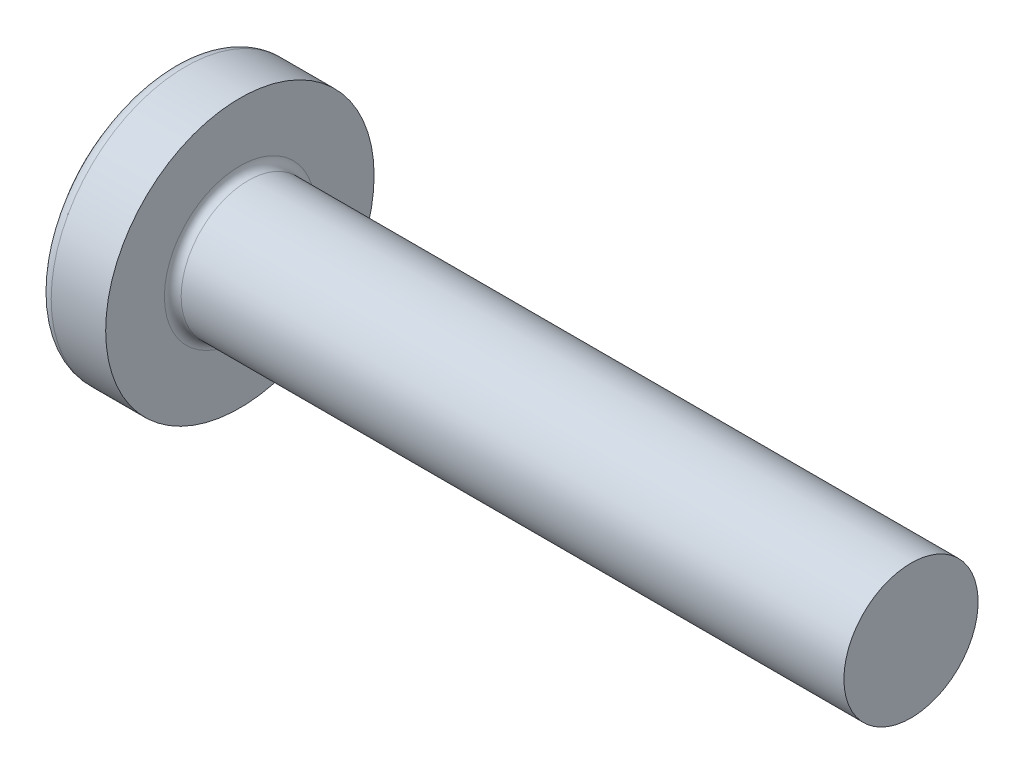
ISO-10303-21;
HEADER;
FILE_DESCRIPTION(('STEP AP214'),'2;1');
FILE_NAME('part.step','',(''),(''),'','','');
FILE_SCHEMA(('AUTOMOTIVE_DESIGN { 1 0 10303 214 1 1 1 1 }'));
ENDSEC;
DATA;
#1=APPLICATION_CONTEXT('core data for automotive mechanical design processes');
#2=APPLICATION_PROTOCOL_DEFINITION('international standard','automotive_design',2000,#1);
#3=PRODUCT_CONTEXT('',#1,'mechanical');
#4=PRODUCT('Part','Part','',(#3));
#5=PRODUCT_RELATED_PRODUCT_CATEGORY('part','',(#4));
#6=PRODUCT_DEFINITION_FORMATION('','',#4);
#7=PRODUCT_DEFINITION_CONTEXT('part definition',#1,'design');
#8=PRODUCT_DEFINITION('design','',#6,#7);
#9=PRODUCT_DEFINITION_SHAPE('','',#8);
#10=(LENGTH_UNIT() NAMED_UNIT(*) SI_UNIT(.MILLI.,.METRE.));
#11=(NAMED_UNIT(*) PLANE_ANGLE_UNIT() SI_UNIT($,.RADIAN.));
#12=(NAMED_UNIT(*) SI_UNIT($,.STERADIAN.) SOLID_ANGLE_UNIT());
#13=UNCERTAINTY_MEASURE_WITH_UNIT(LENGTH_MEASURE(1.E-05),#10,'distance_accuracy_value','');
#14=(GEOMETRIC_REPRESENTATION_CONTEXT(3) GLOBAL_UNCERTAINTY_ASSIGNED_CONTEXT((#13)) GLOBAL_UNIT_ASSIGNED_CONTEXT((#10,
#11,#12)) REPRESENTATION_CONTEXT('',''));
#15=CARTESIAN_POINT('',(0.,0.,0.));
#16=DIRECTION('',(0.,0.,1.));
#17=DIRECTION('',(1.,0.,0.));
#18=AXIS2_PLACEMENT_3D('',#15,#16,#17);
#19=CARTESIAN_POINT('',(2.5,0.,0.));
#20=DIRECTION('',(-1.,0.,0.));
#21=DIRECTION('',(0.,1.,0.));
#22=AXIS2_PLACEMENT_3D('',#19,#20,#21);
#23=SPHERICAL_SURFACE('',#22,2.5);
#24=CARTESIAN_POINT('',(0.532633828839689,0.,0.));
#25=DIRECTION('',(-1.,0.,0.));
#26=DIRECTION('',(0.,0.,1.));
#27=AXIS2_PLACEMENT_3D('',#24,#25,#26);
#28=CIRCLE('',#27,1.54255319148936);
#29=CARTESIAN_POINT('',(0.532633828839689,0.,1.54255319148936));
#30=VERTEX_POINT('',#29);
#31=EDGE_CURVE('E237',#30,#30,#28,.T.);
#32=ORIENTED_EDGE('',*,*,#31,.T.);
#33=EDGE_LOOP('',(#32));
#34=FACE_BOUND('',#33,.T.);
#35=CARTESIAN_POINT('',(0.0348536438778161,0.,0.));
#36=DIRECTION('',(1.,0.,0.));
#37=DIRECTION('',(0.,0.,-1.));
#38=AXIS2_PLACEMENT_3D('',#35,#36,#37);
#39=CIRCLE('',#38,0.415996926548163);
#40=CARTESIAN_POINT('',(0.034853643877816,-0.239999999999999,-0.339784406495528));
#41=VERTEX_POINT('',#40);
#42=CARTESIAN_POINT('',(0.0348536438778161,-0.339784406495527,-0.24));
#43=VERTEX_POINT('',#42);
#44=EDGE_CURVE('E373',#41,#43,#39,.F.);
#45=ORIENTED_EDGE('',*,*,#44,.F.);
#46=CARTESIAN_POINT('',(2.5,-0.24,0.));
#47=DIRECTION('',(0.,1.,0.));
#48=DIRECTION('',(0.,0.,1.));
#49=AXIS2_PLACEMENT_3D('',#46,#47,#48);
#50=CIRCLE('',#49,2.48845333490504);
#51=CARTESIAN_POINT('',(0.12361367782094,-0.239999999999997,-0.738368504041365));
#52=VERTEX_POINT('',#51);
#53=EDGE_CURVE('E299',#52,#41,#50,.T.);
#54=ORIENTED_EDGE('',*,*,#53,.F.);
#55=CARTESIAN_POINT('',(2.32172308413752,0.,0.357568235162189));
#56=DIRECTION('',(0.446197753347436,0.,-0.894934391398443));
#57=DIRECTION('',(-0.894934391398443,0.,-0.446197753347436));
#58=AXIS2_PLACEMENT_3D('',#55,#56,#57);
#59=CIRCLE('',#58,2.46786594013402);
#60=CARTESIAN_POINT('',(0.12361367782094,0.240000000000003,-0.738368504041363));
#61=VERTEX_POINT('',#60);
#62=EDGE_CURVE('E271',#52,#61,#59,.T.);
#63=ORIENTED_EDGE('',*,*,#62,.T.);
#64=CARTESIAN_POINT('',(2.5,0.24,0.));
#65=DIRECTION('',(0.,-1.,0.));
#66=DIRECTION('',(0.,0.,-1.));
#67=AXIS2_PLACEMENT_3D('',#64,#65,#66);
#68=CIRCLE('',#67,2.48845333490504);
#69=CARTESIAN_POINT('',(0.0348536438778164,0.240000000000001,-0.339784406495526));
#70=VERTEX_POINT('',#69);
#71=EDGE_CURVE('E326',#70,#61,#68,.T.);
#72=ORIENTED_EDGE('',*,*,#71,.F.);
#73=CARTESIAN_POINT('',(0.0348536438778161,0.339784406495525,-0.24));
#74=VERTEX_POINT('',#73);
#75=EDGE_CURVE('E392',#74,#70,#39,.F.);
#76=ORIENTED_EDGE('',*,*,#75,.F.);
#77=CARTESIAN_POINT('',(2.5,0.,-0.24));
#78=DIRECTION('',(0.,0.,1.));
#79=DIRECTION('',(1.,0.,0.));
#80=AXIS2_PLACEMENT_3D('',#77,#78,#79);
#81=CIRCLE('',#80,2.48845333490504);
#82=CARTESIAN_POINT('',(0.123613677820941,0.738368504041364,-0.24));
#83=VERTEX_POINT('',#82);
#84=EDGE_CURVE('E265',#83,#74,#81,.T.);
#85=ORIENTED_EDGE('',*,*,#84,.F.);
#86=CARTESIAN_POINT('',(2.32172308413752,-0.357568235162189,0.));
#87=DIRECTION('',(0.446197753347436,0.894934391398443,0.));
#88=DIRECTION('',(-0.894934391398443,0.446197753347436,0.));
#89=AXIS2_PLACEMENT_3D('',#86,#87,#88);
#90=CIRCLE('',#89,2.46786594013402);
#91=CARTESIAN_POINT('',(0.123613677820941,0.738368504041364,0.24));
#92=VERTEX_POINT('',#91);
#93=EDGE_CURVE('E268',#83,#92,#90,.T.);
#94=ORIENTED_EDGE('',*,*,#93,.T.);
#95=CARTESIAN_POINT('',(2.5,0.,0.24));
#96=DIRECTION('',(0.,0.,-1.));
#97=DIRECTION('',(0.,1.,0.));
#98=AXIS2_PLACEMENT_3D('',#95,#96,#97);
#99=CIRCLE('',#98,2.48845333490504);
#100=CARTESIAN_POINT('',(0.0348536438778161,0.339784406495525,0.24));
#101=VERTEX_POINT('',#100);
#102=EDGE_CURVE('E261',#101,#92,#99,.T.);
#103=ORIENTED_EDGE('',*,*,#102,.F.);
#104=CARTESIAN_POINT('',(0.0348536438778166,0.239999999999999,0.339784406495528));
#105=VERTEX_POINT('',#104);
#106=EDGE_CURVE('E391',#105,#101,#39,.F.);
#107=ORIENTED_EDGE('',*,*,#106,.F.);
#108=CARTESIAN_POINT('',(0.123613677820941,0.239999999999997,0.738368504041365));
#109=VERTEX_POINT('',#108);
#110=EDGE_CURVE('E281',#109,#105,#68,.T.);
#111=ORIENTED_EDGE('',*,*,#110,.F.);
#112=CARTESIAN_POINT('',(2.32172308413752,0.,-0.357568235162189));
#113=DIRECTION('',(0.446197753347436,0.,0.894934391398443));
#114=DIRECTION('',(0.894934391398443,0.,-0.446197753347436));
#115=AXIS2_PLACEMENT_3D('',#112,#113,#114);
#116=CIRCLE('',#115,2.46786594013402);
#117=CARTESIAN_POINT('',(0.123613677820941,-0.240000000000002,0.738368504041363));
#118=VERTEX_POINT('',#117);
#119=EDGE_CURVE('E48',#109,#118,#116,.T.);
#120=ORIENTED_EDGE('',*,*,#119,.T.);
#121=CARTESIAN_POINT('',(0.0348536438778153,-0.240000000000001,0.339784406495526));
#122=VERTEX_POINT('',#121);
#123=EDGE_CURVE('E278',#122,#118,#50,.T.);
#124=ORIENTED_EDGE('',*,*,#123,.F.);
#125=CARTESIAN_POINT('',(0.0348536438778161,-0.339784406495527,0.24));
#126=VERTEX_POINT('',#125);
#127=EDGE_CURVE('E431',#126,#122,#39,.F.);
#128=ORIENTED_EDGE('',*,*,#127,.F.);
#129=CARTESIAN_POINT('',(0.12361367782094,-0.738368504041364,0.24));
#130=VERTEX_POINT('',#129);
#131=EDGE_CURVE('E262',#130,#126,#99,.T.);
#132=ORIENTED_EDGE('',*,*,#131,.F.);
#133=CARTESIAN_POINT('',(2.32172308413752,0.357568235162189,0.));
#134=DIRECTION('',(0.446197753347436,-0.894934391398443,0.));
#135=DIRECTION('',(0.894934391398443,0.446197753347436,0.));
#136=AXIS2_PLACEMENT_3D('',#133,#134,#135);
#137=CIRCLE('',#136,2.46786594013402);
#138=CARTESIAN_POINT('',(0.12361367782094,-0.738368504041364,-0.24));
#139=VERTEX_POINT('',#138);
#140=EDGE_CURVE('E258',#130,#139,#137,.T.);
#141=ORIENTED_EDGE('',*,*,#140,.T.);
#142=EDGE_CURVE('E63',#43,#139,#81,.T.);
#143=ORIENTED_EDGE('',*,*,#142,.F.);
#144=EDGE_LOOP('',(#45,#54,#63,#72,#76,#85,#94,#103,#107,#111,#120,#124,#128,#132,#141,#143));
#145=FACE_BOUND('',#144,.T.);
#146=ADVANCED_FACE('F34',(#34,#145),#23,.T.);
#147=CARTESIAN_POINT('',(0.,0.8,-0.24));
#148=DIRECTION('',(0.,0.,1.));
#149=DIRECTION('',(1.,0.,0.));
#150=AXIS2_PLACEMENT_3D('',#147,#148,#149);
#151=PLANE('',#150);
#152=ORIENTED_EDGE('',*,*,#84,.T.);
#153=CARTESIAN_POINT('',(-0.629305626090503,0.395285037112981,-0.24));
#154=CARTESIAN_POINT('',(-0.502245440869322,0.384885761504805,-0.24));
#155=CARTESIAN_POINT('',(-0.375193303991232,0.374386041200533,-0.24));
#156=CARTESIAN_POINT('',(-0.121109362358296,0.353102592236971,-0.24));
#157=CARTESIAN_POINT('',(0.00592244174754057,0.342318855839851,-0.24));
#158=CARTESIAN_POINT('',(0.259954553132912,0.320384813741064,-0.24));
#159=CARTESIAN_POINT('',(0.386954860411929,0.309234508033358,-0.24));
#160=CARTESIAN_POINT('',(0.640908035068629,0.286428502217992,-0.24));
#161=CARTESIAN_POINT('',(0.767860903211905,0.274772810656204,-0.24));
#162=CARTESIAN_POINT('',(1.02740505364565,0.25019581365541,-0.24));
#163=CARTESIAN_POINT('',(1.15999322223083,0.23724116727319,-0.24));
#164=CARTESIAN_POINT('',(1.35878055743682,0.216851377657762,-0.24));
#165=CARTESIAN_POINT('',(1.42502853887614,0.209894992147933,-0.24));
#166=CARTESIAN_POINT('',(1.55747716895953,0.19553674789587,-0.24));
#167=CARTESIAN_POINT('',(1.62367781680677,0.188134881824942,-0.24));
#168=CARTESIAN_POINT('',(1.68984631429485,0.1804472535589,-0.24));
#169=B_SPLINE_CURVE_WITH_KNOTS('',3,(#153,#154,#155,#156,#157,#158,#159,#160,#161,#162,#163,
#164,#165,#166,#167,#168),.UNSPECIFIED.,.F.,.F.,(4,2,2,2,2,2,2,4),(0.,0.382455333743982,
0.764921098031735,1.14738686861956,1.52984617438513,1.92950045825532,2.12933578679645,
2.32917440376966),.UNSPECIFIED.);
#170=CARTESIAN_POINT('',(0.9,0.262259890185289,-0.24));
#171=VERTEX_POINT('',#170);
#172=EDGE_CURVE('E415',#74,#171,#169,.T.);
#173=ORIENTED_EDGE('',*,*,#172,.T.);
#174=DIRECTION('',(0.,1.,0.));
#175=VECTOR('',#174,1.);
#176=CARTESIAN_POINT('',(0.9,-0.351276627792593,-0.24));
#177=LINE('',#176,#175);
#178=CARTESIAN_POINT('',(0.9,0.351276627792593,-0.24));
#179=VERTEX_POINT('',#178);
#180=EDGE_CURVE('E355',#171,#179,#177,.T.);
#181=ORIENTED_EDGE('',*,*,#180,.T.);
#182=DIRECTION('',(0.894934391398443,-0.446197753347436,0.));
#183=VECTOR('',#182,1.);
#184=CARTESIAN_POINT('',(0.,0.8,-0.24));
#185=LINE('',#184,#183);
#186=EDGE_CURVE('E238',#83,#179,#185,.T.);
#187=ORIENTED_EDGE('',*,*,#186,.F.);
#188=EDGE_LOOP('',(#152,#173,#181,#187));
#189=FACE_BOUND('',#188,.T.);
#190=ADVANCED_FACE('F193',(#189),#151,.T.);
#191=CARTESIAN_POINT('',(0.9,-0.351276627792593,-0.24));
#192=VERTEX_POINT('',#191);
#193=CARTESIAN_POINT('',(0.9,-0.262259890185289,-0.24));
#194=VERTEX_POINT('',#193);
#195=EDGE_CURVE('E246',#192,#194,#177,.T.);
#196=ORIENTED_EDGE('',*,*,#195,.T.);
#197=CARTESIAN_POINT('',(-0.629305626090503,-0.395285037112981,-0.24));
#198=CARTESIAN_POINT('',(-0.502245440869322,-0.384885761504805,-0.24));
#199=CARTESIAN_POINT('',(-0.375193303991232,-0.374386041200533,-0.24));
#200=CARTESIAN_POINT('',(-0.121109362358296,-0.353102592236971,-0.24));
#201=CARTESIAN_POINT('',(0.00592244174754057,-0.342318855839851,-0.24));
#202=CARTESIAN_POINT('',(0.259954553132912,-0.320384813741064,-0.24));
#203=CARTESIAN_POINT('',(0.386954860411929,-0.309234508033358,-0.24));
#204=CARTESIAN_POINT('',(0.640908035068629,-0.286428502217992,-0.24));
#205=CARTESIAN_POINT('',(0.767860903211905,-0.274772810656204,-0.24));
#206=CARTESIAN_POINT('',(1.02740505364565,-0.250195813655411,-0.24));
#207=CARTESIAN_POINT('',(1.15999322223082,-0.237241167273191,-0.24));
#208=CARTESIAN_POINT('',(1.35878055743681,-0.216851377657763,-0.24));
#209=CARTESIAN_POINT('',(1.42502853887612,-0.209894992147934,-0.24));
#210=CARTESIAN_POINT('',(1.55747716895951,-0.195536747895872,-0.24));
#211=CARTESIAN_POINT('',(1.62367781680675,-0.188134881824944,-0.24));
#212=CARTESIAN_POINT('',(1.68984631429483,-0.180447253558903,-0.24));
#213=B_SPLINE_CURVE_WITH_KNOTS('',3,(#197,#198,#199,#200,#201,#202,#203,#204,#205,#206,#207,
#208,#209,#210,#211,#212),.UNSPECIFIED.,.F.,.F.,(4,2,2,2,2,2,2,4),(0.,0.382455333743982,
0.764921098031735,1.14738686861956,1.52984617438513,1.92950045825531,2.12933578679644,
2.32917440376964),.UNSPECIFIED.);
#214=EDGE_CURVE('E390',#194,#43,#213,.F.);
#215=ORIENTED_EDGE('',*,*,#214,.T.);
#216=ORIENTED_EDGE('',*,*,#142,.T.);
#217=DIRECTION('',(0.894934391398443,0.446197753347436,0.));
#218=VECTOR('',#217,1.);
#219=CARTESIAN_POINT('',(0.,-0.8,-0.24));
#220=LINE('',#219,#218);
#221=EDGE_CURVE('E329',#139,#192,#220,.T.);
#222=ORIENTED_EDGE('',*,*,#221,.T.);
#223=EDGE_LOOP('',(#196,#215,#216,#222));
#224=FACE_BOUND('',#223,.T.);
#225=ADVANCED_FACE('F199',(#224),#151,.T.);
#226=CARTESIAN_POINT('',(0.,-0.799999999999999,0.24));
#227=DIRECTION('',(0.,0.,-1.));
#228=DIRECTION('',(0.,1.,0.));
#229=AXIS2_PLACEMENT_3D('',#226,#227,#228);
#230=PLANE('',#229);
#231=DIRECTION('',(0.,-1.,0.));
#232=VECTOR('',#231,1.);
#233=CARTESIAN_POINT('',(0.9,0.351276627792594,0.24));
#234=LINE('',#233,#232);
#235=CARTESIAN_POINT('',(0.9,0.351276627792593,0.24));
#236=VERTEX_POINT('',#235);
#237=CARTESIAN_POINT('',(0.9,0.262259890185289,0.24));
#238=VERTEX_POINT('',#237);
#239=EDGE_CURVE('E338',#236,#238,#234,.T.);
#240=ORIENTED_EDGE('',*,*,#239,.T.);
#241=CARTESIAN_POINT('',(-0.629305630567791,0.395285037479254,0.24));
#242=CARTESIAN_POINT('',(-0.502245444906561,0.384885761837513,0.24));
#243=CARTESIAN_POINT('',(-0.375193307588419,0.374386041499475,0.24));
#244=CARTESIAN_POINT('',(-0.121109365075987,0.353102592467066,0.24));
#245=CARTESIAN_POINT('',(0.00592243946929318,0.342318856034865,0.24));
#246=CARTESIAN_POINT('',(0.259954552394606,0.320384813806507,0.24));
#247=CARTESIAN_POINT('',(0.386954860773955,0.309234508002403,0.24));
#248=CARTESIAN_POINT('',(0.640908037631128,0.28642850198631,0.24));
#249=CARTESIAN_POINT('',(0.767860906874544,0.27477281032019,0.24));
#250=CARTESIAN_POINT('',(1.02740503497565,0.250195815411899,0.24));
#251=CARTESIAN_POINT('',(1.15999318014164,0.237241171372315,0.24));
#252=CARTESIAN_POINT('',(1.35878048026026,0.216851385682783,0.24));
#253=CARTESIAN_POINT('',(1.42502845000982,0.209895001550346,0.24));
#254=CARTESIAN_POINT('',(1.55747705673948,0.195536760284769,0.24));
#255=CARTESIAN_POINT('',(1.62367769292276,0.188134895822942,0.24));
#256=CARTESIAN_POINT('',(1.68984617876647,0.180447269328967,0.24));
#257=B_SPLINE_CURVE_WITH_KNOTS('',3,(#241,#242,#243,#244,#245,#246,#247,#248,#249,#250,#251,
#252,#253,#254,#255,#256),.UNSPECIFIED.,.F.,.F.,(4,2,2,2,2,2,2,4),(0.,0.382455335067977,
0.764921100678223,1.14738687457974,1.52984618366023,1.92950039692501,2.12933569015817,
2.32917427182041),.UNSPECIFIED.);
#258=EDGE_CURVE('E670',#238,#101,#257,.F.);
#259=ORIENTED_EDGE('',*,*,#258,.T.);
#260=ORIENTED_EDGE('',*,*,#102,.T.);
#261=DIRECTION('',(0.894934391398443,-0.446197753347436,0.));
#262=VECTOR('',#261,1.);
#263=CARTESIAN_POINT('',(0.,0.8,0.24));
#264=LINE('',#263,#262);
#265=EDGE_CURVE('E243',#92,#236,#264,.T.);
#266=ORIENTED_EDGE('',*,*,#265,.T.);
#267=EDGE_LOOP('',(#240,#259,#260,#266));
#268=FACE_BOUND('',#267,.T.);
#269=ADVANCED_FACE('F411',(#268),#230,.T.);
#270=ORIENTED_EDGE('',*,*,#131,.T.);
#271=CARTESIAN_POINT('',(-0.629305626090503,-0.395285037112982,0.24));
#272=CARTESIAN_POINT('',(-0.502245440869322,-0.384885761504805,0.24));
#273=CARTESIAN_POINT('',(-0.375193303991232,-0.374386041200533,0.24));
#274=CARTESIAN_POINT('',(-0.121109362358296,-0.353102592236972,0.24));
#275=CARTESIAN_POINT('',(0.00592244174754051,-0.342318855839852,0.24));
#276=CARTESIAN_POINT('',(0.259954553132912,-0.320384813741064,0.24));
#277=CARTESIAN_POINT('',(0.386954860411929,-0.309234508033358,0.24));
#278=CARTESIAN_POINT('',(0.640908035068629,-0.286428502217992,0.24));
#279=CARTESIAN_POINT('',(0.767860903211905,-0.274772810656204,0.24));
#280=CARTESIAN_POINT('',(1.02740505364565,-0.25019581365541,0.24));
#281=CARTESIAN_POINT('',(1.15999322223083,-0.237241167273191,0.24));
#282=CARTESIAN_POINT('',(1.35878055743682,-0.216851377657762,0.24));
#283=CARTESIAN_POINT('',(1.42502853887614,-0.209894992147933,0.24));
#284=CARTESIAN_POINT('',(1.55747716895953,-0.19553674789587,0.24));
#285=CARTESIAN_POINT('',(1.62367781680677,-0.188134881824942,0.24));
#286=CARTESIAN_POINT('',(1.68984631429485,-0.1804472535589,0.24));
#287=B_SPLINE_CURVE_WITH_KNOTS('',3,(#271,#272,#273,#274,#275,#276,#277,#278,#279,#280,#281,
#282,#283,#284,#285,#286),.UNSPECIFIED.,.F.,.F.,(4,2,2,2,2,2,2,4),(0.,0.382455333743982,
0.764921098031735,1.14738686861956,1.52984617438513,1.92950045825532,2.12933578679645,
2.32917440376966),.UNSPECIFIED.);
#288=CARTESIAN_POINT('',(0.9,-0.262259890185289,0.24));
#289=VERTEX_POINT('',#288);
#290=EDGE_CURVE('E432',#126,#289,#287,.T.);
#291=ORIENTED_EDGE('',*,*,#290,.T.);
#292=CARTESIAN_POINT('',(0.9,-0.351276627792593,0.24));
#293=VERTEX_POINT('',#292);
#294=EDGE_CURVE('E340',#289,#293,#234,.T.);
#295=ORIENTED_EDGE('',*,*,#294,.T.);
#296=DIRECTION('',(0.894934391398443,0.446197753347436,0.));
#297=VECTOR('',#296,1.);
#298=CARTESIAN_POINT('',(0.,-0.8,0.24));
#299=LINE('',#298,#297);
#300=EDGE_CURVE('E331',#130,#293,#299,.T.);
#301=ORIENTED_EDGE('',*,*,#300,.F.);
#302=EDGE_LOOP('',(#270,#291,#295,#301));
#303=FACE_BOUND('',#302,.T.);
#304=ADVANCED_FACE('F518',(#303),#230,.T.);
#305=CARTESIAN_POINT('',(0.9,0.351276627792594,0.24));
#306=DIRECTION('',(0.446197753347436,0.894934391398443,0.));
#307=DIRECTION('',(-0.894934391398443,0.446197753347436,0.));
#308=AXIS2_PLACEMENT_3D('',#305,#306,#307);
#309=PLANE('',#308);
#310=CARTESIAN_POINT('',(1.51667990224654,0.0438114218941496,0.));
#311=DIRECTION('',(0.446197753347436,0.894934391398443,0.));
#312=DIRECTION('',(-0.894934391398443,0.446197753347436,0.));
#313=AXIS2_PLACEMENT_3D('',#310,#311,#312);
#314=ELLIPSE('',#313,0.700087658673246,0.309289972496479);
#315=CARTESIAN_POINT('',(0.9,0.351276627792594,0.0546349775021752));
#316=VERTEX_POINT('',#315);
#317=CARTESIAN_POINT('',(0.9,0.351276627792594,-0.0546349775021753));
#318=VERTEX_POINT('',#317);
#319=EDGE_CURVE('E304',#316,#318,#314,.F.);
#320=ORIENTED_EDGE('',*,*,#319,.F.);
#321=DIRECTION('',(0.,0.,-1.));
#322=VECTOR('',#321,1.);
#323=CARTESIAN_POINT('',(0.9,0.351276627792594,0.24));
#324=LINE('',#323,#322);
#325=EDGE_CURVE('E341',#236,#316,#324,.T.);
#326=ORIENTED_EDGE('',*,*,#325,.F.);
#327=ORIENTED_EDGE('',*,*,#265,.F.);
#328=ORIENTED_EDGE('',*,*,#93,.F.);
#329=ORIENTED_EDGE('',*,*,#186,.T.);
#330=EDGE_CURVE('E343',#318,#179,#324,.T.);
#331=ORIENTED_EDGE('',*,*,#330,.F.);
#332=EDGE_LOOP('',(#320,#326,#327,#328,#329,#331));
#333=FACE_BOUND('',#332,.T.);
#334=ADVANCED_FACE('F409',(#333),#309,.F.);
#335=CARTESIAN_POINT('',(0.9,-0.351276627792593,-0.24));
#336=DIRECTION('',(0.446197753347436,-0.894934391398443,0.));
#337=DIRECTION('',(0.894934391398443,0.446197753347436,0.));
#338=AXIS2_PLACEMENT_3D('',#335,#336,#337);
#339=PLANE('',#338);
#340=CARTESIAN_POINT('',(1.51667990224654,-0.0438114218941494,0.));
#341=DIRECTION('',(0.446197753347436,-0.894934391398443,0.));
#342=DIRECTION('',(-0.894934391398443,-0.446197753347436,0.));
#343=AXIS2_PLACEMENT_3D('',#340,#341,#342);
#344=ELLIPSE('',#343,0.700087658673246,0.30928997249648);
#345=CARTESIAN_POINT('',(0.9,-0.351276627792594,-0.054634977502177));
#346=VERTEX_POINT('',#345);
#347=CARTESIAN_POINT('',(0.9,-0.351276627792594,0.0546349775021769));
#348=VERTEX_POINT('',#347);
#349=EDGE_CURVE('E672',#346,#348,#344,.F.);
#350=ORIENTED_EDGE('',*,*,#349,.F.);
#351=DIRECTION('',(0.,0.,1.));
#352=VECTOR('',#351,1.);
#353=CARTESIAN_POINT('',(0.9,-0.351276627792593,-0.24));
#354=LINE('',#353,#352);
#355=EDGE_CURVE('E334',#192,#346,#354,.T.);
#356=ORIENTED_EDGE('',*,*,#355,.F.);
#357=ORIENTED_EDGE('',*,*,#221,.F.);
#358=ORIENTED_EDGE('',*,*,#140,.F.);
#359=ORIENTED_EDGE('',*,*,#300,.T.);
#360=EDGE_CURVE('E337',#348,#293,#354,.T.);
#361=ORIENTED_EDGE('',*,*,#360,.F.);
#362=EDGE_LOOP('',(#350,#356,#357,#358,#359,#361));
#363=FACE_BOUND('',#362,.T.);
#364=ADVANCED_FACE('F505',(#363),#339,.F.);
#365=CARTESIAN_POINT('',(0.9,0.351276627792593,-0.24));
#366=DIRECTION('',(-1.,0.,0.));
#367=DIRECTION('',(0.,0.,1.));
#368=AXIS2_PLACEMENT_3D('',#365,#366,#367);
#369=PLANE('',#368);
#370=DIRECTION('',(0.,1.,0.));
#371=VECTOR('',#370,1.);
#372=CARTESIAN_POINT('',(0.9,-0.240000000000001,0.351276627792593));
#373=LINE('',#372,#371);
#374=CARTESIAN_POINT('',(0.9,-0.240000000000001,0.351276627792593));
#375=VERTEX_POINT('',#374);
#376=CARTESIAN_POINT('',(0.9,-0.0546349775021799,0.351276627792593));
#377=VERTEX_POINT('',#376);
#378=EDGE_CURVE('E319',#375,#377,#373,.T.);
#379=ORIENTED_EDGE('',*,*,#378,.T.);
#380=CARTESIAN_POINT('',(0.9,0.,0.));
#381=DIRECTION('',(-1.,0.,0.));
#382=DIRECTION('',(0.,0.,1.));
#383=AXIS2_PLACEMENT_3D('',#380,#381,#382);
#384=CIRCLE('',#383,0.3555);
#385=CARTESIAN_POINT('',(0.9,-0.240000000000001,0.262259890185288));
#386=VERTEX_POINT('',#385);
#387=EDGE_CURVE('E700',#386,#377,#384,.T.);
#388=ORIENTED_EDGE('',*,*,#387,.F.);
#389=DIRECTION('',(0.,0.,-1.));
#390=VECTOR('',#389,1.);
#391=CARTESIAN_POINT('',(0.9,-0.240000000000001,0.351276627792593));
#392=LINE('',#391,#390);
#393=EDGE_CURVE('E315',#375,#386,#392,.T.);
#394=ORIENTED_EDGE('',*,*,#393,.F.);
#395=EDGE_LOOP('',(#379,#388,#394));
#396=FACE_BOUND('',#395,.T.);
#397=ADVANCED_FACE('F498',(#396),#369,.T.);
#398=ORIENTED_EDGE('',*,*,#294,.F.);
#399=EDGE_CURVE('E705',#348,#289,#384,.T.);
#400=ORIENTED_EDGE('',*,*,#399,.F.);
#401=ORIENTED_EDGE('',*,*,#360,.T.);
#402=EDGE_LOOP('',(#398,#400,#401));
#403=FACE_BOUND('',#402,.T.);
#404=ADVANCED_FACE('F491',(#403),#369,.T.);
#405=ORIENTED_EDGE('',*,*,#355,.T.);
#406=EDGE_CURVE('E384',#194,#346,#384,.T.);
#407=ORIENTED_EDGE('',*,*,#406,.F.);
#408=ORIENTED_EDGE('',*,*,#195,.F.);
#409=EDGE_LOOP('',(#405,#407,#408));
#410=FACE_BOUND('',#409,.T.);
#411=ADVANCED_FACE('F485',(#410),#369,.T.);
#412=CARTESIAN_POINT('',(0.9,-0.239999999999999,-0.262259890185289));
#413=VERTEX_POINT('',#412);
#414=CARTESIAN_POINT('',(0.9,-0.239999999999999,-0.351276627792594));
#415=VERTEX_POINT('',#414);
#416=EDGE_CURVE('E318',#413,#415,#392,.T.);
#417=ORIENTED_EDGE('',*,*,#416,.F.);
#418=CARTESIAN_POINT('',(0.9,-0.0546349775021792,-0.351276627792594));
#419=VERTEX_POINT('',#418);
#420=EDGE_CURVE('E55',#419,#413,#384,.T.);
#421=ORIENTED_EDGE('',*,*,#420,.F.);
#422=DIRECTION('',(0.,-1.,0.));
#423=VECTOR('',#422,1.);
#424=CARTESIAN_POINT('',(0.9,0.240000000000001,-0.351276627792592));
#425=LINE('',#424,#423);
#426=EDGE_CURVE('E314',#419,#415,#425,.T.);
#427=ORIENTED_EDGE('',*,*,#426,.T.);
#428=EDGE_LOOP('',(#417,#421,#427));
#429=FACE_BOUND('',#428,.T.);
#430=ADVANCED_FACE('F379',(#429),#369,.T.);
#431=CARTESIAN_POINT('',(0.9,0.240000000000001,-0.351276627792592));
#432=VERTEX_POINT('',#431);
#433=CARTESIAN_POINT('',(0.9,0.0546349775021817,-0.351276627792593));
#434=VERTEX_POINT('',#433);
#435=EDGE_CURVE('E311',#432,#434,#425,.T.);
#436=ORIENTED_EDGE('',*,*,#435,.T.);
#437=CARTESIAN_POINT('',(0.9,0.240000000000001,-0.262259890185288));
#438=VERTEX_POINT('',#437);
#439=EDGE_CURVE('E383',#438,#434,#384,.T.);
#440=ORIENTED_EDGE('',*,*,#439,.F.);
#441=DIRECTION('',(0.,0.,1.));
#442=VECTOR('',#441,1.);
#443=CARTESIAN_POINT('',(0.9,0.240000000000001,-0.351276627792592));
#444=LINE('',#443,#442);
#445=EDGE_CURVE('E323',#432,#438,#444,.T.);
#446=ORIENTED_EDGE('',*,*,#445,.F.);
#447=EDGE_LOOP('',(#436,#440,#446));
#448=FACE_BOUND('',#447,.T.);
#449=ADVANCED_FACE('F473',(#448),#369,.T.);
#450=ORIENTED_EDGE('',*,*,#180,.F.);
#451=EDGE_CURVE('E689',#318,#171,#384,.T.);
#452=ORIENTED_EDGE('',*,*,#451,.F.);
#453=ORIENTED_EDGE('',*,*,#330,.T.);
#454=EDGE_LOOP('',(#450,#452,#453));
#455=FACE_BOUND('',#454,.T.);
#456=ADVANCED_FACE('F466',(#455),#369,.T.);
#457=ORIENTED_EDGE('',*,*,#325,.T.);
#458=EDGE_CURVE('E691',#238,#316,#384,.T.);
#459=ORIENTED_EDGE('',*,*,#458,.F.);
#460=ORIENTED_EDGE('',*,*,#239,.F.);
#461=EDGE_LOOP('',(#457,#459,#460));
#462=FACE_BOUND('',#461,.T.);
#463=ADVANCED_FACE('F460',(#462),#369,.T.);
#464=CARTESIAN_POINT('',(0.,0.239999999999997,0.8));
#465=DIRECTION('',(0.,-1.,0.));
#466=DIRECTION('',(1.,0.,0.));
#467=AXIS2_PLACEMENT_3D('',#464,#465,#466);
#468=PLANE('',#467);
#469=ORIENTED_EDGE('',*,*,#110,.T.);
#470=CARTESIAN_POINT('',(-0.629305626090503,0.239999999999999,0.395285037112982));
#471=CARTESIAN_POINT('',(-0.502245440869322,0.239999999999999,0.384885761504805));
#472=CARTESIAN_POINT('',(-0.375193303991232,0.239999999999999,0.374386041200533));
#473=CARTESIAN_POINT('',(-0.121109362358296,0.239999999999999,0.353102592236972));
#474=CARTESIAN_POINT('',(0.00592244174754065,0.239999999999999,0.342318855839852));
#475=CARTESIAN_POINT('',(0.259954553132912,0.239999999999999,0.320384813741065));
#476=CARTESIAN_POINT('',(0.386954860411929,0.239999999999999,0.309234508033359));
#477=CARTESIAN_POINT('',(0.640908035068629,0.239999999999999,0.286428502217993));
#478=CARTESIAN_POINT('',(0.767860903211905,0.239999999999999,0.274772810656205));
#479=CARTESIAN_POINT('',(1.02740505364566,0.239999999999999,0.250195813655411));
#480=CARTESIAN_POINT('',(1.15999322223084,0.239999999999999,0.23724116727319));
#481=CARTESIAN_POINT('',(1.35878055743683,0.239999999999999,0.216851377657761));
#482=CARTESIAN_POINT('',(1.42502853887615,0.239999999999999,0.209894992147932));
#483=CARTESIAN_POINT('',(1.55747716895955,0.239999999999999,0.195536747895869));
#484=CARTESIAN_POINT('',(1.62367781680679,0.239999999999999,0.18813488182494));
#485=CARTESIAN_POINT('',(1.68984631429487,0.239999999999999,0.180447253558898));
#486=B_SPLINE_CURVE_WITH_KNOTS('',3,(#470,#471,#472,#473,#474,#475,#476,#477,#478,#479,#480,
#481,#482,#483,#484,#485),.UNSPECIFIED.,.F.,.F.,(4,2,2,2,2,2,2,4),(0.,0.382455333743982,
0.764921098031735,1.14738686861956,1.52984617438513,1.92950045825533,2.12933578679647,
2.32917440376968),.UNSPECIFIED.);
#487=CARTESIAN_POINT('',(0.9,0.239999999999999,0.26225989018529));
#488=VERTEX_POINT('',#487);
#489=EDGE_CURVE('E669',#105,#488,#486,.T.);
#490=ORIENTED_EDGE('',*,*,#489,.T.);
#491=CARTESIAN_POINT('',(0.9,0.239999999999999,0.351276627792594));
#492=VERTEX_POINT('',#491);
#493=EDGE_CURVE('E296',#488,#492,#444,.T.);
#494=ORIENTED_EDGE('',*,*,#493,.T.);
#495=DIRECTION('',(0.894934391398443,0.,-0.446197753347436));
#496=VECTOR('',#495,1.);
#497=CARTESIAN_POINT('',(0.,0.239999999999997,0.800000000000001));
#498=LINE('',#497,#496);
#499=EDGE_CURVE('E289',#109,#492,#498,.T.);
#500=ORIENTED_EDGE('',*,*,#499,.F.);
#501=EDGE_LOOP('',(#469,#490,#494,#500));
#502=FACE_BOUND('',#501,.T.);
#503=ADVANCED_FACE('F293',(#502),#468,.T.);
#504=CARTESIAN_POINT('',(0.,-0.239999999999997,-0.8));
#505=DIRECTION('',(0.,1.,0.));
#506=DIRECTION('',(0.,0.,1.));
#507=AXIS2_PLACEMENT_3D('',#504,#505,#506);
#508=PLANE('',#507);
#509=ORIENTED_EDGE('',*,*,#393,.T.);
#510=CARTESIAN_POINT('',(-0.629305626090503,-0.240000000000001,0.395285037112981));
#511=CARTESIAN_POINT('',(-0.502245440869322,-0.240000000000001,0.384885761504804));
#512=CARTESIAN_POINT('',(-0.375193303991232,-0.240000000000001,0.374386041200532));
#513=CARTESIAN_POINT('',(-0.121109362358296,-0.240000000000001,0.353102592236971));
#514=CARTESIAN_POINT('',(0.00592244174754057,-0.240000000000001,0.342318855839851));
#515=CARTESIAN_POINT('',(0.259954553132912,-0.240000000000001,0.320384813741063));
#516=CARTESIAN_POINT('',(0.386954860411929,-0.240000000000001,0.309234508033357));
#517=CARTESIAN_POINT('',(0.640908035068629,-0.240000000000001,0.286428502217991));
#518=CARTESIAN_POINT('',(0.767860903211905,-0.240000000000001,0.274772810656203));
#519=CARTESIAN_POINT('',(1.02740505364565,-0.240000000000001,0.250195813655409));
#520=CARTESIAN_POINT('',(1.15999322223083,-0.240000000000001,0.23724116727319));
#521=CARTESIAN_POINT('',(1.35878055743682,-0.240000000000001,0.216851377657761));
#522=CARTESIAN_POINT('',(1.42502853887614,-0.240000000000001,0.209894992147932));
#523=CARTESIAN_POINT('',(1.55747716895953,-0.240000000000001,0.195536747895869));
#524=CARTESIAN_POINT('',(1.62367781680677,-0.240000000000001,0.188134881824941));
#525=CARTESIAN_POINT('',(1.68984631429485,-0.240000000000001,0.180447253558899));
#526=B_SPLINE_CURVE_WITH_KNOTS('',3,(#510,#511,#512,#513,#514,#515,#516,#517,#518,#519,#520,
#521,#522,#523,#524,#525),.UNSPECIFIED.,.F.,.F.,(4,2,2,2,2,2,2,4),(0.,0.382455333743982,
0.764921098031735,1.14738686861956,1.52984617438513,1.92950045825532,2.12933578679645,
2.32917440376966),.UNSPECIFIED.);
#527=EDGE_CURVE('E424',#386,#122,#526,.F.);
#528=ORIENTED_EDGE('',*,*,#527,.T.);
#529=ORIENTED_EDGE('',*,*,#123,.T.);
#530=DIRECTION('',(0.894934391398443,0.,-0.446197753347436));
#531=VECTOR('',#530,1.);
#532=CARTESIAN_POINT('',(0.,-0.240000000000003,0.799999999999999));
#533=LINE('',#532,#531);
#534=EDGE_CURVE('E291',#118,#375,#533,.T.);
#535=ORIENTED_EDGE('',*,*,#534,.T.);
#536=EDGE_LOOP('',(#509,#528,#529,#535));
#537=FACE_BOUND('',#536,.T.);
#538=ADVANCED_FACE('F228',(#537),#508,.T.);
#539=CARTESIAN_POINT('',(0.9,-0.240000000000001,0.351276627792593));
#540=DIRECTION('',(0.446197753347436,0.,0.894934391398443));
#541=DIRECTION('',(-0.894934391398443,0.,0.446197753347436));
#542=AXIS2_PLACEMENT_3D('',#539,#540,#541);
#543=PLANE('',#542);
#544=CARTESIAN_POINT('',(1.51667990224654,0.,0.0438114218941495));
#545=DIRECTION('',(0.446197753347436,0.,0.894934391398443));
#546=DIRECTION('',(-0.894934391398443,0.,0.446197753347436));
#547=AXIS2_PLACEMENT_3D('',#544,#545,#546);
#548=ELLIPSE('',#547,0.700087658673246,0.309289972496479);
#549=CARTESIAN_POINT('',(0.9,0.0546349775021776,0.351276627792594));
#550=VERTEX_POINT('',#549);
#551=EDGE_CURVE('E422',#377,#550,#548,.F.);
#552=ORIENTED_EDGE('',*,*,#551,.F.);
#553=ORIENTED_EDGE('',*,*,#378,.F.);
#554=ORIENTED_EDGE('',*,*,#534,.F.);
#555=ORIENTED_EDGE('',*,*,#119,.F.);
#556=ORIENTED_EDGE('',*,*,#499,.T.);
#557=EDGE_CURVE('E322',#550,#492,#373,.T.);
#558=ORIENTED_EDGE('',*,*,#557,.F.);
#559=EDGE_LOOP('',(#552,#553,#554,#555,#556,#558));
#560=FACE_BOUND('',#559,.T.);
#561=ADVANCED_FACE('F287',(#560),#543,.F.);
#562=CARTESIAN_POINT('',(0.9,0.240000000000001,-0.351276627792592));
#563=DIRECTION('',(0.446197753347436,0.,-0.894934391398443));
#564=DIRECTION('',(0.894934391398443,0.,0.446197753347436));
#565=AXIS2_PLACEMENT_3D('',#562,#563,#564);
#566=PLANE('',#565);
#567=CARTESIAN_POINT('',(1.51667990224654,0.,-0.0438114218941494));
#568=DIRECTION('',(0.446197753347436,0.,-0.894934391398443));
#569=DIRECTION('',(-0.894934391398443,0.,-0.446197753347436));
#570=AXIS2_PLACEMENT_3D('',#567,#568,#569);
#571=ELLIPSE('',#570,0.700087658673246,0.30928997249648);
#572=EDGE_CURVE('E377',#434,#419,#571,.F.);
#573=ORIENTED_EDGE('',*,*,#572,.F.);
#574=ORIENTED_EDGE('',*,*,#435,.F.);
#575=DIRECTION('',(0.894934391398443,0.,0.446197753347436));
#576=VECTOR('',#575,1.);
#577=CARTESIAN_POINT('',(0.,0.240000000000003,-0.799999999999999));
#578=LINE('',#577,#576);
#579=EDGE_CURVE('E301',#61,#432,#578,.T.);
#580=ORIENTED_EDGE('',*,*,#579,.F.);
#581=ORIENTED_EDGE('',*,*,#62,.F.);
#582=DIRECTION('',(0.894934391398443,0.,0.446197753347436));
#583=VECTOR('',#582,1.);
#584=CARTESIAN_POINT('',(0.,-0.239999999999997,-0.800000000000001));
#585=LINE('',#584,#583);
#586=EDGE_CURVE('E308',#52,#415,#585,.T.);
#587=ORIENTED_EDGE('',*,*,#586,.T.);
#588=ORIENTED_EDGE('',*,*,#426,.F.);
#589=EDGE_LOOP('',(#573,#574,#580,#581,#587,#588));
#590=FACE_BOUND('',#589,.T.);
#591=ADVANCED_FACE('F368',(#590),#566,.F.);
#592=ORIENTED_EDGE('',*,*,#445,.T.);
#593=CARTESIAN_POINT('',(-0.629305630567791,0.240000000000001,-0.395285037479253));
#594=CARTESIAN_POINT('',(-0.502245444906561,0.240000000000001,-0.384885761837512));
#595=CARTESIAN_POINT('',(-0.375193307588419,0.240000000000001,-0.374386041499475));
#596=CARTESIAN_POINT('',(-0.121109365075988,0.240000000000001,-0.353102592467065));
#597=CARTESIAN_POINT('',(0.00592243946929302,0.240000000000001,-0.342318856034864));
#598=CARTESIAN_POINT('',(0.259954552394606,0.240000000000001,-0.320384813806506));
#599=CARTESIAN_POINT('',(0.386954860773955,0.240000000000001,-0.309234508002402));
#600=CARTESIAN_POINT('',(0.640908037631128,0.240000000000001,-0.286428501986309));
#601=CARTESIAN_POINT('',(0.767860906874544,0.240000000000001,-0.27477281032019));
#602=CARTESIAN_POINT('',(1.02740503497566,0.240000000000001,-0.250195815411897));
#603=CARTESIAN_POINT('',(1.15999318014166,0.240000000000001,-0.237241171372313));
#604=CARTESIAN_POINT('',(1.35878048026029,0.240000000000001,-0.216851385682779));
#605=CARTESIAN_POINT('',(1.42502845000985,0.240000000000001,-0.209895001550342));
#606=CARTESIAN_POINT('',(1.55747705673952,0.240000000000001,-0.195536760284763));
#607=CARTESIAN_POINT('',(1.6236776929228,0.240000000000001,-0.188134895822936));
#608=CARTESIAN_POINT('',(1.68984617876653,0.240000000000001,-0.180447269328961));
#609=B_SPLINE_CURVE_WITH_KNOTS('',3,(#593,#594,#595,#596,#597,#598,#599,#600,#601,#602,#603,
#604,#605,#606,#607,#608),.UNSPECIFIED.,.F.,.F.,(4,2,2,2,2,2,2,4),(0.,0.382455335067977,
0.764921100678223,1.14738687457974,1.52984618366023,1.92950039692503,2.12933569015821,
2.32917427182046),.UNSPECIFIED.);
#610=EDGE_CURVE('E364',#438,#70,#609,.F.);
#611=ORIENTED_EDGE('',*,*,#610,.T.);
#612=ORIENTED_EDGE('',*,*,#71,.T.);
#613=ORIENTED_EDGE('',*,*,#579,.T.);
#614=EDGE_LOOP('',(#592,#611,#612,#613));
#615=FACE_BOUND('',#614,.T.);
#616=ADVANCED_FACE('F226',(#615),#468,.T.);
#617=ORIENTED_EDGE('',*,*,#53,.T.);
#618=CARTESIAN_POINT('',(-0.629305626090503,-0.239999999999998,-0.395285037112982));
#619=CARTESIAN_POINT('',(-0.502245440869322,-0.239999999999998,-0.384885761504806));
#620=CARTESIAN_POINT('',(-0.375193303991232,-0.239999999999998,-0.374386041200534));
#621=CARTESIAN_POINT('',(-0.121109362358296,-0.239999999999999,-0.353102592236972));
#622=CARTESIAN_POINT('',(0.00592244174754059,-0.239999999999999,-0.342318855839852));
#623=CARTESIAN_POINT('',(0.259954553132913,-0.239999999999999,-0.320384813741065));
#624=CARTESIAN_POINT('',(0.386954860411929,-0.239999999999999,-0.309234508033359));
#625=CARTESIAN_POINT('',(0.640908035068629,-0.239999999999999,-0.286428502217993));
#626=CARTESIAN_POINT('',(0.767860903211905,-0.239999999999999,-0.274772810656205));
#627=CARTESIAN_POINT('',(1.02740505364565,-0.239999999999999,-0.250195813655411));
#628=CARTESIAN_POINT('',(1.15999322223083,-0.239999999999999,-0.237241167273191));
#629=CARTESIAN_POINT('',(1.35878055743682,-0.239999999999999,-0.216851377657762));
#630=CARTESIAN_POINT('',(1.42502853887614,-0.239999999999999,-0.209894992147933));
#631=CARTESIAN_POINT('',(1.55747716895953,-0.239999999999999,-0.19553674789587));
#632=CARTESIAN_POINT('',(1.62367781680677,-0.239999999999999,-0.188134881824942));
#633=CARTESIAN_POINT('',(1.68984631429485,-0.239999999999999,-0.1804472535589));
#634=B_SPLINE_CURVE_WITH_KNOTS('',3,(#618,#619,#620,#621,#622,#623,#624,#625,#626,#627,#628,
#629,#630,#631,#632,#633),.UNSPECIFIED.,.F.,.F.,(4,2,2,2,2,2,2,4),(0.,0.382455333743982,
0.764921098031735,1.14738686861956,1.52984617438513,1.92950045825532,2.12933578679645,
2.32917440376966),.UNSPECIFIED.);
#635=EDGE_CURVE('E11',#41,#413,#634,.T.);
#636=ORIENTED_EDGE('',*,*,#635,.T.);
#637=ORIENTED_EDGE('',*,*,#416,.T.);
#638=ORIENTED_EDGE('',*,*,#586,.F.);
#639=EDGE_LOOP('',(#617,#636,#637,#638));
#640=FACE_BOUND('',#639,.T.);
#641=ADVANCED_FACE('F221',(#640),#508,.T.);
#642=CARTESIAN_POINT('',(-25.4,0.,0.));
#643=DIRECTION('',(-1.,0.,0.));
#644=DIRECTION('',(0.,0.,1.));
#645=AXIS2_PLACEMENT_3D('',#642,#643,#644);
#646=CYLINDRICAL_SURFACE('',#645,0.8);
#647=CARTESIAN_POINT('',(1.4,0.,0.));
#648=DIRECTION('',(-1.,0.,0.));
#649=DIRECTION('',(0.,0.,1.));
#650=AXIS2_PLACEMENT_3D('',#647,#648,#649);
#651=CIRCLE('',#650,0.8);
#652=CARTESIAN_POINT('',(1.4,0.,0.8));
#653=VERTEX_POINT('',#652);
#654=EDGE_CURVE('E232',#653,#653,#651,.F.);
#655=ORIENTED_EDGE('',*,*,#654,.T.);
#656=EDGE_LOOP('',(#655));
#657=FACE_BOUND('',#656,.T.);
#658=CARTESIAN_POINT('',(9.3,0.,0.));
#659=DIRECTION('',(-1.,0.,0.));
#660=DIRECTION('',(0.,0.,1.));
#661=AXIS2_PLACEMENT_3D('',#658,#659,#660);
#662=CIRCLE('',#661,0.8);
#663=CARTESIAN_POINT('',(9.3,0.,0.8));
#664=VERTEX_POINT('',#663);
#665=EDGE_CURVE('E235',#664,#664,#662,.T.);
#666=ORIENTED_EDGE('',*,*,#665,.T.);
#667=EDGE_LOOP('',(#666));
#668=FACE_BOUND('',#667,.T.);
#669=ADVANCED_FACE('F218',(#657,#668),#646,.T.);
#670=CARTESIAN_POINT('',(1.3,0.8,0.));
#671=DIRECTION('',(-1.,0.,0.));
#672=DIRECTION('',(0.,0.,1.));
#673=AXIS2_PLACEMENT_3D('',#670,#671,#672);
#674=PLANE('',#673);
#675=CARTESIAN_POINT('',(1.3,0.,0.));
#676=DIRECTION('',(-1.,0.,0.));
#677=DIRECTION('',(0.,0.,1.));
#678=AXIS2_PLACEMENT_3D('',#675,#676,#677);
#679=CIRCLE('',#678,0.9);
#680=CARTESIAN_POINT('',(1.3,0.,0.9));
#681=VERTEX_POINT('',#680);
#682=EDGE_CURVE('E254',#681,#681,#679,.T.);
#683=ORIENTED_EDGE('',*,*,#682,.T.);
#684=EDGE_LOOP('',(#683));
#685=FACE_BOUND('',#684,.T.);
#686=CARTESIAN_POINT('',(1.3,0.,0.));
#687=DIRECTION('',(-1.,0.,0.));
#688=DIRECTION('',(0.,0.,1.));
#689=AXIS2_PLACEMENT_3D('',#686,#687,#688);
#690=CIRCLE('',#689,1.6);
#691=CARTESIAN_POINT('',(1.3,0.,1.6));
#692=VERTEX_POINT('',#691);
#693=EDGE_CURVE('E251',#692,#692,#690,.T.);
#694=ORIENTED_EDGE('',*,*,#693,.F.);
#695=EDGE_LOOP('',(#694));
#696=FACE_BOUND('',#695,.T.);
#697=ADVANCED_FACE('F215',(#685,#696),#674,.F.);
#698=CARTESIAN_POINT('',(-25.4,0.,0.));
#699=DIRECTION('',(-1.,0.,0.));
#700=DIRECTION('',(0.,0.,1.));
#701=AXIS2_PLACEMENT_3D('',#698,#699,#700);
#702=CYLINDRICAL_SURFACE('',#701,1.6);
#703=ORIENTED_EDGE('',*,*,#693,.T.);
#704=EDGE_LOOP('',(#703));
#705=FACE_BOUND('',#704,.T.);
#706=CARTESIAN_POINT('',(0.650675799109306,0.,0.));
#707=DIRECTION('',(-1.,0.,0.));
#708=DIRECTION('',(0.,0.,1.));
#709=AXIS2_PLACEMENT_3D('',#706,#707,#708);
#710=CIRCLE('',#709,1.6);
#711=CARTESIAN_POINT('',(0.650675799109306,0.,1.6));
#712=VERTEX_POINT('',#711);
#713=EDGE_CURVE('E240',#712,#712,#710,.T.);
#714=ORIENTED_EDGE('',*,*,#713,.F.);
#715=EDGE_LOOP('',(#714));
#716=FACE_BOUND('',#715,.T.);
#717=ADVANCED_FACE('F211',(#705,#716),#702,.T.);
#718=CARTESIAN_POINT('',(0.650675799109308,0.,0.));
#719=DIRECTION('',(-1.,0.,0.));
#720=DIRECTION('',(0.,0.,1.));
#721=AXIS2_PLACEMENT_3D('',#718,#719,#720);
#722=TOROIDAL_SURFACE('',#721,1.45,0.15);
#723=ORIENTED_EDGE('',*,*,#713,.T.);
#724=EDGE_LOOP('',(#723));
#725=FACE_BOUND('',#724,.T.);
#726=ORIENTED_EDGE('',*,*,#31,.F.);
#727=EDGE_LOOP('',(#726));
#728=FACE_BOUND('',#727,.T.);
#729=ADVANCED_FACE('F208',(#725,#728),#722,.T.);
#730=CARTESIAN_POINT('',(9.3,0.8,0.));
#731=DIRECTION('',(1.,0.,0.));
#732=DIRECTION('',(0.,0.,-1.));
#733=AXIS2_PLACEMENT_3D('',#730,#731,#732);
#734=PLANE('',#733);
#735=ORIENTED_EDGE('',*,*,#665,.F.);
#736=EDGE_LOOP('',(#735));
#737=FACE_BOUND('',#736,.T.);
#738=ADVANCED_FACE('F206',(#737),#734,.T.);
#739=CARTESIAN_POINT('',(1.4,0.,0.));
#740=DIRECTION('',(-1.,0.,0.));
#741=DIRECTION('',(0.,0.,1.));
#742=AXIS2_PLACEMENT_3D('',#739,#740,#741);
#743=TOROIDAL_SURFACE('',#742,0.9,0.1);
#744=ORIENTED_EDGE('',*,*,#654,.F.);
#745=EDGE_LOOP('',(#744));
#746=FACE_BOUND('',#745,.T.);
#747=ORIENTED_EDGE('',*,*,#682,.F.);
#748=EDGE_LOOP('',(#747));
#749=FACE_BOUND('',#748,.T.);
#750=ADVANCED_FACE('F36',(#746,#749),#743,.F.);
#751=ORIENTED_EDGE('',*,*,#493,.F.);
#752=EDGE_CURVE('E385',#550,#488,#384,.T.);
#753=ORIENTED_EDGE('',*,*,#752,.F.);
#754=ORIENTED_EDGE('',*,*,#557,.T.);
#755=EDGE_LOOP('',(#751,#753,#754));
#756=FACE_BOUND('',#755,.T.);
#757=ADVANCED_FACE('F467',(#756),#369,.T.);
#758=CARTESIAN_POINT('',(0.9,0.,0.));
#759=DIRECTION('',(-1.,0.,0.));
#760=DIRECTION('',(0.,0.,1.));
#761=AXIS2_PLACEMENT_3D('',#758,#759,#760);
#762=CONICAL_SURFACE('',#761,0.3555,0.0698131700797659);
#763=ORIENTED_EDGE('',*,*,#319,.T.);
#764=EDGE_CURVE('E686',#316,#318,#384,.T.);
#765=ORIENTED_EDGE('',*,*,#764,.F.);
#766=EDGE_LOOP('',(#763,#765));
#767=FACE_BOUND('',#766,.T.);
#768=ADVANCED_FACE('F190',(#767),#762,.F.);
#769=ORIENTED_EDGE('',*,*,#349,.T.);
#770=EDGE_CURVE('E706',#346,#348,#384,.T.);
#771=ORIENTED_EDGE('',*,*,#770,.F.);
#772=EDGE_LOOP('',(#769,#771));
#773=FACE_BOUND('',#772,.T.);
#774=ADVANCED_FACE('F600',(#773),#762,.F.);
#775=EDGE_CURVE('E387',#488,#238,#384,.T.);
#776=ORIENTED_EDGE('',*,*,#775,.F.);
#777=ORIENTED_EDGE('',*,*,#489,.F.);
#778=ORIENTED_EDGE('',*,*,#106,.T.);
#779=ORIENTED_EDGE('',*,*,#258,.F.);
#780=EDGE_LOOP('',(#776,#777,#778,#779));
#781=FACE_BOUND('',#780,.T.);
#782=ADVANCED_FACE('F606',(#781),#762,.F.);
#783=ORIENTED_EDGE('',*,*,#551,.T.);
#784=EDGE_CURVE('E388',#377,#550,#384,.T.);
#785=ORIENTED_EDGE('',*,*,#784,.F.);
#786=EDGE_LOOP('',(#783,#785));
#787=FACE_BOUND('',#786,.T.);
#788=ADVANCED_FACE('F613',(#787),#762,.F.);
#789=ORIENTED_EDGE('',*,*,#572,.T.);
#790=EDGE_CURVE('E380',#434,#419,#384,.T.);
#791=ORIENTED_EDGE('',*,*,#790,.F.);
#792=EDGE_LOOP('',(#789,#791));
#793=FACE_BOUND('',#792,.T.);
#794=ADVANCED_FACE('F620',(#793),#762,.F.);
#795=ORIENTED_EDGE('',*,*,#127,.T.);
#796=ORIENTED_EDGE('',*,*,#527,.F.);
#797=EDGE_CURVE('E702',#289,#386,#384,.T.);
#798=ORIENTED_EDGE('',*,*,#797,.F.);
#799=ORIENTED_EDGE('',*,*,#290,.F.);
#800=EDGE_LOOP('',(#795,#796,#798,#799));
#801=FACE_BOUND('',#800,.T.);
#802=ADVANCED_FACE('F627',(#801),#762,.F.);
#803=ORIENTED_EDGE('',*,*,#75,.T.);
#804=ORIENTED_EDGE('',*,*,#610,.F.);
#805=EDGE_CURVE('E692',#171,#438,#384,.T.);
#806=ORIENTED_EDGE('',*,*,#805,.F.);
#807=ORIENTED_EDGE('',*,*,#172,.F.);
#808=EDGE_LOOP('',(#803,#804,#806,#807));
#809=FACE_BOUND('',#808,.T.);
#810=ADVANCED_FACE('F188',(#809),#762,.F.);
#811=EDGE_CURVE('E381',#413,#194,#384,.T.);
#812=ORIENTED_EDGE('',*,*,#811,.F.);
#813=ORIENTED_EDGE('',*,*,#635,.F.);
#814=ORIENTED_EDGE('',*,*,#44,.T.);
#815=ORIENTED_EDGE('',*,*,#214,.F.);
#816=EDGE_LOOP('',(#812,#813,#814,#815));
#817=FACE_BOUND('',#816,.T.);
#818=ADVANCED_FACE('F183',(#817),#762,.F.);
#819=CARTESIAN_POINT('',(1.01550895201079,0.,0.));
#820=DIRECTION('',(-1.,0.,0.));
#821=DIRECTION('',(0.,0.,1.));
#822=AXIS2_PLACEMENT_3D('',#819,#820,#821);
#823=CONICAL_SURFACE('',#822,0.,1.25663706143593);
#824=ORIENTED_EDGE('',*,*,#752,.T.);
#825=ORIENTED_EDGE('',*,*,#775,.T.);
#826=ORIENTED_EDGE('',*,*,#458,.T.);
#827=ORIENTED_EDGE('',*,*,#764,.T.);
#828=ORIENTED_EDGE('',*,*,#451,.T.);
#829=ORIENTED_EDGE('',*,*,#805,.T.);
#830=ORIENTED_EDGE('',*,*,#439,.T.);
#831=ORIENTED_EDGE('',*,*,#790,.T.);
#832=ORIENTED_EDGE('',*,*,#420,.T.);
#833=ORIENTED_EDGE('',*,*,#811,.T.);
#834=ORIENTED_EDGE('',*,*,#406,.T.);
#835=ORIENTED_EDGE('',*,*,#770,.T.);
#836=ORIENTED_EDGE('',*,*,#399,.T.);
#837=ORIENTED_EDGE('',*,*,#797,.T.);
#838=ORIENTED_EDGE('',*,*,#387,.T.);
#839=ORIENTED_EDGE('',*,*,#784,.T.);
#840=EDGE_LOOP('',(#824,#825,#826,#827,#828,#829,#830,#831,#832,#833,#834,#835,#836,#837,#838,#839));
#841=FACE_BOUND('',#840,.T.);
#842=CARTESIAN_POINT('',(1.01550895201079,0.,0.));
#843=VERTEX_POINT('',#842);
#844=VERTEX_LOOP('',#843);
#845=FACE_BOUND('',#844,.T.);
#846=ADVANCED_FACE('F181',(#841,#845),#823,.F.);
#847=CLOSED_SHELL('',(#146,#190,#225,#269,#304,#334,#364,#397,#404,#411,#430,#449,#456,#463,
#503,#538,#561,#591,#616,#641,#669,#697,#717,#729,#738,#750,#757,#768,#774,#782,#788,#794,#802,
#810,#818,#846));
#848=MANIFOLD_SOLID_BREP('B2',#847);
#849=ADVANCED_BREP_SHAPE_REPRESENTATION('',(#18,#848),#14);
#850=SHAPE_DEFINITION_REPRESENTATION(#9,#849);
ENDSEC;
END-ISO-10303-21;
